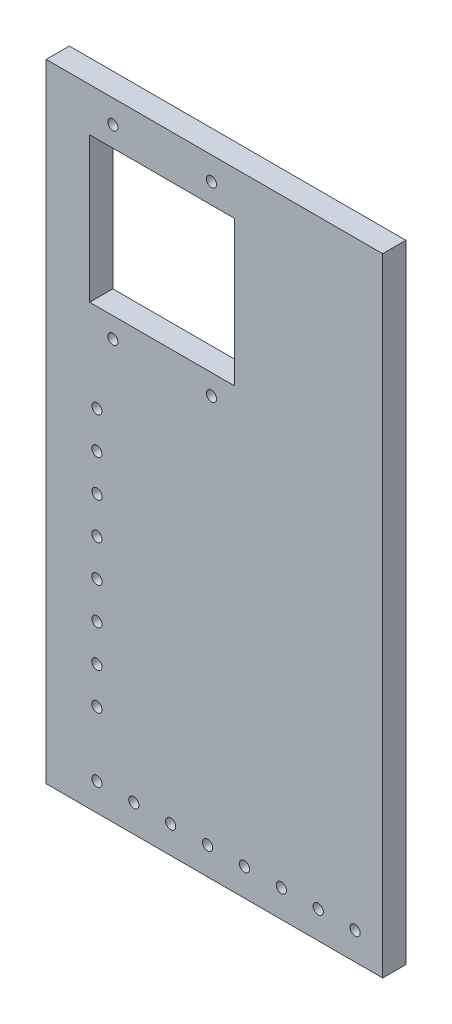
ISO-10303-21;
HEADER;
FILE_DESCRIPTION(('STEP AP214'),'2;1');
FILE_NAME('part.step','',(''),(''),'','','');
FILE_SCHEMA(('AUTOMOTIVE_DESIGN { 1 0 10303 214 1 1 1 1 }'));
ENDSEC;
DATA;
#1=APPLICATION_CONTEXT('core data for automotive mechanical design processes');
#2=APPLICATION_PROTOCOL_DEFINITION('international standard','automotive_design',2000,#1);
#3=PRODUCT_CONTEXT('',#1,'mechanical');
#4=PRODUCT('Part','Part','',(#3));
#5=PRODUCT_RELATED_PRODUCT_CATEGORY('part','',(#4));
#6=PRODUCT_DEFINITION_FORMATION('','',#4);
#7=PRODUCT_DEFINITION_CONTEXT('part definition',#1,'design');
#8=PRODUCT_DEFINITION('design','',#6,#7);
#9=PRODUCT_DEFINITION_SHAPE('','',#8);
#10=(LENGTH_UNIT() NAMED_UNIT(*) SI_UNIT(.MILLI.,.METRE.));
#11=(NAMED_UNIT(*) PLANE_ANGLE_UNIT() SI_UNIT($,.RADIAN.));
#12=(NAMED_UNIT(*) SI_UNIT($,.STERADIAN.) SOLID_ANGLE_UNIT());
#13=UNCERTAINTY_MEASURE_WITH_UNIT(LENGTH_MEASURE(1.E-05),#10,'distance_accuracy_value','');
#14=(GEOMETRIC_REPRESENTATION_CONTEXT(3) GLOBAL_UNCERTAINTY_ASSIGNED_CONTEXT((#13)) GLOBAL_UNIT_ASSIGNED_CONTEXT((#10,
#11,#12)) REPRESENTATION_CONTEXT('',''));
#15=CARTESIAN_POINT('',(0.,0.,0.));
#16=DIRECTION('',(0.,0.,1.));
#17=DIRECTION('',(1.,0.,0.));
#18=AXIS2_PLACEMENT_3D('',#15,#16,#17);
#19=CARTESIAN_POINT('',(-22.5,-144.5,100.));
#20=DIRECTION('',(0.,0.,-1.));
#21=DIRECTION('',(-1.,0.,0.));
#22=AXIS2_PLACEMENT_3D('',#19,#20,#21);
#23=CYLINDRICAL_SURFACE('',#22,1.75);
#24=CARTESIAN_POINT('',(-22.5,-144.5,8.00000000000001));
#25=DIRECTION('',(0.,0.,1.));
#26=DIRECTION('',(1.,0.,0.));
#27=AXIS2_PLACEMENT_3D('',#24,#25,#26);
#28=CIRCLE('',#27,1.75);
#29=CARTESIAN_POINT('',(-20.75,-144.5,8.00000000000001));
#30=VERTEX_POINT('',#29);
#31=EDGE_CURVE('E48',#30,#30,#28,.T.);
#32=ORIENTED_EDGE('',*,*,#31,.T.);
#33=EDGE_LOOP('',(#32));
#34=FACE_BOUND('',#33,.T.);
#35=CARTESIAN_POINT('',(-22.5,-144.5,0.));
#36=DIRECTION('',(0.,0.,-1.));
#37=DIRECTION('',(-1.,0.,0.));
#38=AXIS2_PLACEMENT_3D('',#35,#36,#37);
#39=CIRCLE('',#38,1.75);
#40=CARTESIAN_POINT('',(-24.25,-144.5,0.));
#41=VERTEX_POINT('',#40);
#42=EDGE_CURVE('E11',#41,#41,#39,.T.);
#43=ORIENTED_EDGE('',*,*,#42,.T.);
#44=EDGE_LOOP('',(#43));
#45=FACE_BOUND('',#44,.T.);
#46=ADVANCED_FACE('F41',(#34,#45),#23,.F.);
#47=CARTESIAN_POINT('',(-22.5,-131.785714285714,100.));
#48=DIRECTION('',(0.,0.,-1.));
#49=DIRECTION('',(-1.,0.,0.));
#50=AXIS2_PLACEMENT_3D('',#47,#48,#49);
#51=CYLINDRICAL_SURFACE('',#50,1.75);
#52=CARTESIAN_POINT('',(-22.5,-131.785714285714,8.00000000000001));
#53=DIRECTION('',(0.,0.,1.));
#54=DIRECTION('',(1.,0.,0.));
#55=AXIS2_PLACEMENT_3D('',#52,#53,#54);
#56=CIRCLE('',#55,1.75);
#57=CARTESIAN_POINT('',(-20.75,-131.785714285714,8.00000000000001));
#58=VERTEX_POINT('',#57);
#59=EDGE_CURVE('E258',#58,#58,#56,.T.);
#60=ORIENTED_EDGE('',*,*,#59,.T.);
#61=EDGE_LOOP('',(#60));
#62=FACE_BOUND('',#61,.T.);
#63=CARTESIAN_POINT('',(-22.5,-131.785714285714,0.));
#64=DIRECTION('',(0.,0.,-1.));
#65=DIRECTION('',(-1.,0.,0.));
#66=AXIS2_PLACEMENT_3D('',#63,#64,#65);
#67=CIRCLE('',#66,1.75);
#68=CARTESIAN_POINT('',(-24.25,-131.785714285714,0.));
#69=VERTEX_POINT('',#68);
#70=EDGE_CURVE('E261',#69,#69,#67,.T.);
#71=ORIENTED_EDGE('',*,*,#70,.T.);
#72=EDGE_LOOP('',(#71));
#73=FACE_BOUND('',#72,.T.);
#74=ADVANCED_FACE('F287',(#62,#73),#51,.F.);
#75=CARTESIAN_POINT('',(-22.5,-119.071428571429,100.));
#76=DIRECTION('',(0.,0.,-1.));
#77=DIRECTION('',(-1.,0.,0.));
#78=AXIS2_PLACEMENT_3D('',#75,#76,#77);
#79=CYLINDRICAL_SURFACE('',#78,1.75);
#80=CARTESIAN_POINT('',(-22.5,-119.071428571429,8.00000000000001));
#81=DIRECTION('',(0.,0.,1.));
#82=DIRECTION('',(1.,0.,0.));
#83=AXIS2_PLACEMENT_3D('',#80,#81,#82);
#84=CIRCLE('',#83,1.75);
#85=CARTESIAN_POINT('',(-20.75,-119.071428571429,8.00000000000001));
#86=VERTEX_POINT('',#85);
#87=EDGE_CURVE('E252',#86,#86,#84,.T.);
#88=ORIENTED_EDGE('',*,*,#87,.T.);
#89=EDGE_LOOP('',(#88));
#90=FACE_BOUND('',#89,.T.);
#91=CARTESIAN_POINT('',(-22.5,-119.071428571429,0.));
#92=DIRECTION('',(0.,0.,-1.));
#93=DIRECTION('',(-1.,0.,0.));
#94=AXIS2_PLACEMENT_3D('',#91,#92,#93);
#95=CIRCLE('',#94,1.75);
#96=CARTESIAN_POINT('',(-24.25,-119.071428571429,0.));
#97=VERTEX_POINT('',#96);
#98=EDGE_CURVE('E255',#97,#97,#95,.T.);
#99=ORIENTED_EDGE('',*,*,#98,.T.);
#100=EDGE_LOOP('',(#99));
#101=FACE_BOUND('',#100,.T.);
#102=ADVANCED_FACE('F291',(#90,#101),#79,.F.);
#103=CARTESIAN_POINT('',(-22.5,-106.357142857143,100.));
#104=DIRECTION('',(0.,0.,-1.));
#105=DIRECTION('',(-1.,0.,0.));
#106=AXIS2_PLACEMENT_3D('',#103,#104,#105);
#107=CYLINDRICAL_SURFACE('',#106,1.75);
#108=CARTESIAN_POINT('',(-22.5,-106.357142857143,8.00000000000001));
#109=DIRECTION('',(0.,0.,1.));
#110=DIRECTION('',(1.,0.,0.));
#111=AXIS2_PLACEMENT_3D('',#108,#109,#110);
#112=CIRCLE('',#111,1.75);
#113=CARTESIAN_POINT('',(-20.75,-106.357142857143,8.00000000000001));
#114=VERTEX_POINT('',#113);
#115=EDGE_CURVE('E246',#114,#114,#112,.T.);
#116=ORIENTED_EDGE('',*,*,#115,.T.);
#117=EDGE_LOOP('',(#116));
#118=FACE_BOUND('',#117,.T.);
#119=CARTESIAN_POINT('',(-22.5,-106.357142857143,0.));
#120=DIRECTION('',(0.,0.,-1.));
#121=DIRECTION('',(-1.,0.,0.));
#122=AXIS2_PLACEMENT_3D('',#119,#120,#121);
#123=CIRCLE('',#122,1.75);
#124=CARTESIAN_POINT('',(-24.25,-106.357142857143,0.));
#125=VERTEX_POINT('',#124);
#126=EDGE_CURVE('E249',#125,#125,#123,.T.);
#127=ORIENTED_EDGE('',*,*,#126,.T.);
#128=EDGE_LOOP('',(#127));
#129=FACE_BOUND('',#128,.T.);
#130=ADVANCED_FACE('F296',(#118,#129),#107,.F.);
#131=CARTESIAN_POINT('',(-22.5,-93.6428571428572,100.));
#132=DIRECTION('',(0.,0.,-1.));
#133=DIRECTION('',(-1.,0.,0.));
#134=AXIS2_PLACEMENT_3D('',#131,#132,#133);
#135=CYLINDRICAL_SURFACE('',#134,1.75);
#136=CARTESIAN_POINT('',(-22.5,-93.6428571428572,8.00000000000001));
#137=DIRECTION('',(0.,0.,1.));
#138=DIRECTION('',(1.,0.,0.));
#139=AXIS2_PLACEMENT_3D('',#136,#137,#138);
#140=CIRCLE('',#139,1.75);
#141=CARTESIAN_POINT('',(-20.75,-93.6428571428572,8.00000000000001));
#142=VERTEX_POINT('',#141);
#143=EDGE_CURVE('E240',#142,#142,#140,.T.);
#144=ORIENTED_EDGE('',*,*,#143,.T.);
#145=EDGE_LOOP('',(#144));
#146=FACE_BOUND('',#145,.T.);
#147=CARTESIAN_POINT('',(-22.5,-93.6428571428572,0.));
#148=DIRECTION('',(0.,0.,-1.));
#149=DIRECTION('',(-1.,0.,0.));
#150=AXIS2_PLACEMENT_3D('',#147,#148,#149);
#151=CIRCLE('',#150,1.75);
#152=CARTESIAN_POINT('',(-24.25,-93.6428571428572,0.));
#153=VERTEX_POINT('',#152);
#154=EDGE_CURVE('E243',#153,#153,#151,.T.);
#155=ORIENTED_EDGE('',*,*,#154,.T.);
#156=EDGE_LOOP('',(#155));
#157=FACE_BOUND('',#156,.T.);
#158=ADVANCED_FACE('F303',(#146,#157),#135,.F.);
#159=CARTESIAN_POINT('',(-22.5,-80.9285714285715,100.));
#160=DIRECTION('',(0.,0.,-1.));
#161=DIRECTION('',(-1.,0.,0.));
#162=AXIS2_PLACEMENT_3D('',#159,#160,#161);
#163=CYLINDRICAL_SURFACE('',#162,1.75);
#164=CARTESIAN_POINT('',(-22.5,-80.9285714285715,8.00000000000001));
#165=DIRECTION('',(0.,0.,1.));
#166=DIRECTION('',(1.,0.,0.));
#167=AXIS2_PLACEMENT_3D('',#164,#165,#166);
#168=CIRCLE('',#167,1.75);
#169=CARTESIAN_POINT('',(-20.75,-80.9285714285715,8.00000000000001));
#170=VERTEX_POINT('',#169);
#171=EDGE_CURVE('E234',#170,#170,#168,.T.);
#172=ORIENTED_EDGE('',*,*,#171,.T.);
#173=EDGE_LOOP('',(#172));
#174=FACE_BOUND('',#173,.T.);
#175=CARTESIAN_POINT('',(-22.5,-80.9285714285715,0.));
#176=DIRECTION('',(0.,0.,-1.));
#177=DIRECTION('',(-1.,0.,0.));
#178=AXIS2_PLACEMENT_3D('',#175,#176,#177);
#179=CIRCLE('',#178,1.75);
#180=CARTESIAN_POINT('',(-24.25,-80.9285714285715,0.));
#181=VERTEX_POINT('',#180);
#182=EDGE_CURVE('E237',#181,#181,#179,.T.);
#183=ORIENTED_EDGE('',*,*,#182,.T.);
#184=EDGE_LOOP('',(#183));
#185=FACE_BOUND('',#184,.T.);
#186=ADVANCED_FACE('F307',(#174,#185),#163,.F.);
#187=CARTESIAN_POINT('',(-22.5,-166.73,100.));
#188=DIRECTION('',(0.,0.,-1.));
#189=DIRECTION('',(-1.,0.,0.));
#190=AXIS2_PLACEMENT_3D('',#187,#188,#189);
#191=CYLINDRICAL_SURFACE('',#190,1.75);
#192=CARTESIAN_POINT('',(-22.5,-166.73,8.00000000000001));
#193=DIRECTION('',(0.,0.,1.));
#194=DIRECTION('',(1.,0.,0.));
#195=AXIS2_PLACEMENT_3D('',#192,#193,#194);
#196=CIRCLE('',#195,1.75);
#197=CARTESIAN_POINT('',(-20.75,-166.73,8.00000000000001));
#198=VERTEX_POINT('',#197);
#199=EDGE_CURVE('E228',#198,#198,#196,.T.);
#200=ORIENTED_EDGE('',*,*,#199,.T.);
#201=EDGE_LOOP('',(#200));
#202=FACE_BOUND('',#201,.T.);
#203=CARTESIAN_POINT('',(-22.5,-166.73,0.));
#204=DIRECTION('',(0.,0.,-1.));
#205=DIRECTION('',(-1.,0.,0.));
#206=AXIS2_PLACEMENT_3D('',#203,#204,#205);
#207=CIRCLE('',#206,1.75);
#208=CARTESIAN_POINT('',(-24.25,-166.73,0.));
#209=VERTEX_POINT('',#208);
#210=EDGE_CURVE('E231',#209,#209,#207,.T.);
#211=ORIENTED_EDGE('',*,*,#210,.T.);
#212=EDGE_LOOP('',(#211));
#213=FACE_BOUND('',#212,.T.);
#214=ADVANCED_FACE('F311',(#202,#213),#191,.F.);
#215=CARTESIAN_POINT('',(-9.78571428571427,-166.73,100.));
#216=DIRECTION('',(0.,0.,-1.));
#217=DIRECTION('',(-1.,0.,0.));
#218=AXIS2_PLACEMENT_3D('',#215,#216,#217);
#219=CYLINDRICAL_SURFACE('',#218,1.75);
#220=CARTESIAN_POINT('',(-9.78571428571427,-166.73,8.00000000000001));
#221=DIRECTION('',(0.,0.,1.));
#222=DIRECTION('',(1.,0.,0.));
#223=AXIS2_PLACEMENT_3D('',#220,#221,#222);
#224=CIRCLE('',#223,1.75);
#225=CARTESIAN_POINT('',(-8.03571428571427,-166.73,8.00000000000001));
#226=VERTEX_POINT('',#225);
#227=EDGE_CURVE('E222',#226,#226,#224,.T.);
#228=ORIENTED_EDGE('',*,*,#227,.T.);
#229=EDGE_LOOP('',(#228));
#230=FACE_BOUND('',#229,.T.);
#231=CARTESIAN_POINT('',(-9.78571428571427,-166.73,0.));
#232=DIRECTION('',(0.,0.,-1.));
#233=DIRECTION('',(-1.,0.,0.));
#234=AXIS2_PLACEMENT_3D('',#231,#232,#233);
#235=CIRCLE('',#234,1.75);
#236=CARTESIAN_POINT('',(-11.5357142857143,-166.73,0.));
#237=VERTEX_POINT('',#236);
#238=EDGE_CURVE('E225',#237,#237,#235,.T.);
#239=ORIENTED_EDGE('',*,*,#238,.T.);
#240=EDGE_LOOP('',(#239));
#241=FACE_BOUND('',#240,.T.);
#242=ADVANCED_FACE('F315',(#230,#241),#219,.F.);
#243=CARTESIAN_POINT('',(2.92857142857145,-166.73,100.));
#244=DIRECTION('',(0.,0.,-1.));
#245=DIRECTION('',(-1.,0.,0.));
#246=AXIS2_PLACEMENT_3D('',#243,#244,#245);
#247=CYLINDRICAL_SURFACE('',#246,1.75);
#248=CARTESIAN_POINT('',(2.92857142857145,-166.73,8.00000000000001));
#249=DIRECTION('',(0.,0.,1.));
#250=DIRECTION('',(1.,0.,0.));
#251=AXIS2_PLACEMENT_3D('',#248,#249,#250);
#252=CIRCLE('',#251,1.75);
#253=CARTESIAN_POINT('',(4.67857142857144,-166.73,8.00000000000001));
#254=VERTEX_POINT('',#253);
#255=EDGE_CURVE('E216',#254,#254,#252,.T.);
#256=ORIENTED_EDGE('',*,*,#255,.T.);
#257=EDGE_LOOP('',(#256));
#258=FACE_BOUND('',#257,.T.);
#259=CARTESIAN_POINT('',(2.92857142857145,-166.73,0.));
#260=DIRECTION('',(0.,0.,-1.));
#261=DIRECTION('',(-1.,0.,0.));
#262=AXIS2_PLACEMENT_3D('',#259,#260,#261);
#263=CIRCLE('',#262,1.75);
#264=CARTESIAN_POINT('',(1.17857142857145,-166.73,0.));
#265=VERTEX_POINT('',#264);
#266=EDGE_CURVE('E219',#265,#265,#263,.T.);
#267=ORIENTED_EDGE('',*,*,#266,.T.);
#268=EDGE_LOOP('',(#267));
#269=FACE_BOUND('',#268,.T.);
#270=ADVANCED_FACE('F319',(#258,#269),#247,.F.);
#271=CARTESIAN_POINT('',(15.6428571428572,-166.73,100.));
#272=DIRECTION('',(0.,0.,-1.));
#273=DIRECTION('',(-1.,0.,0.));
#274=AXIS2_PLACEMENT_3D('',#271,#272,#273);
#275=CYLINDRICAL_SURFACE('',#274,1.75);
#276=CARTESIAN_POINT('',(15.6428571428572,-166.73,8.00000000000001));
#277=DIRECTION('',(0.,0.,1.));
#278=DIRECTION('',(1.,0.,0.));
#279=AXIS2_PLACEMENT_3D('',#276,#277,#278);
#280=CIRCLE('',#279,1.75);
#281=CARTESIAN_POINT('',(17.3928571428572,-166.73,8.00000000000001));
#282=VERTEX_POINT('',#281);
#283=EDGE_CURVE('E210',#282,#282,#280,.T.);
#284=ORIENTED_EDGE('',*,*,#283,.T.);
#285=EDGE_LOOP('',(#284));
#286=FACE_BOUND('',#285,.T.);
#287=CARTESIAN_POINT('',(15.6428571428572,-166.73,0.));
#288=DIRECTION('',(0.,0.,-1.));
#289=DIRECTION('',(-1.,0.,0.));
#290=AXIS2_PLACEMENT_3D('',#287,#288,#289);
#291=CIRCLE('',#290,1.75);
#292=CARTESIAN_POINT('',(13.8928571428572,-166.73,0.));
#293=VERTEX_POINT('',#292);
#294=EDGE_CURVE('E213',#293,#293,#291,.T.);
#295=ORIENTED_EDGE('',*,*,#294,.T.);
#296=EDGE_LOOP('',(#295));
#297=FACE_BOUND('',#296,.T.);
#298=ADVANCED_FACE('F323',(#286,#297),#275,.F.);
#299=CARTESIAN_POINT('',(28.3571428571429,-166.73,100.));
#300=DIRECTION('',(0.,0.,-1.));
#301=DIRECTION('',(-1.,0.,0.));
#302=AXIS2_PLACEMENT_3D('',#299,#300,#301);
#303=CYLINDRICAL_SURFACE('',#302,1.75);
#304=CARTESIAN_POINT('',(28.3571428571429,-166.73,8.00000000000001));
#305=DIRECTION('',(0.,0.,1.));
#306=DIRECTION('',(1.,0.,0.));
#307=AXIS2_PLACEMENT_3D('',#304,#305,#306);
#308=CIRCLE('',#307,1.75);
#309=CARTESIAN_POINT('',(30.1071428571429,-166.73,8.00000000000001));
#310=VERTEX_POINT('',#309);
#311=EDGE_CURVE('E204',#310,#310,#308,.T.);
#312=ORIENTED_EDGE('',*,*,#311,.T.);
#313=EDGE_LOOP('',(#312));
#314=FACE_BOUND('',#313,.T.);
#315=CARTESIAN_POINT('',(28.3571428571429,-166.73,0.));
#316=DIRECTION('',(0.,0.,-1.));
#317=DIRECTION('',(-1.,0.,0.));
#318=AXIS2_PLACEMENT_3D('',#315,#316,#317);
#319=CIRCLE('',#318,1.75);
#320=CARTESIAN_POINT('',(26.6071428571429,-166.73,0.));
#321=VERTEX_POINT('',#320);
#322=EDGE_CURVE('E207',#321,#321,#319,.T.);
#323=ORIENTED_EDGE('',*,*,#322,.T.);
#324=EDGE_LOOP('',(#323));
#325=FACE_BOUND('',#324,.T.);
#326=ADVANCED_FACE('F280',(#314,#325),#303,.F.);
#327=CARTESIAN_POINT('',(41.0714285714286,-166.73,100.));
#328=DIRECTION('',(0.,0.,-1.));
#329=DIRECTION('',(-1.,0.,0.));
#330=AXIS2_PLACEMENT_3D('',#327,#328,#329);
#331=CYLINDRICAL_SURFACE('',#330,1.75);
#332=CARTESIAN_POINT('',(41.0714285714286,-166.73,8.00000000000001));
#333=DIRECTION('',(0.,0.,1.));
#334=DIRECTION('',(1.,0.,0.));
#335=AXIS2_PLACEMENT_3D('',#332,#333,#334);
#336=CIRCLE('',#335,1.75);
#337=CARTESIAN_POINT('',(42.8214285714286,-166.73,8.00000000000001));
#338=VERTEX_POINT('',#337);
#339=EDGE_CURVE('E198',#338,#338,#336,.T.);
#340=ORIENTED_EDGE('',*,*,#339,.T.);
#341=EDGE_LOOP('',(#340));
#342=FACE_BOUND('',#341,.T.);
#343=CARTESIAN_POINT('',(41.0714285714286,-166.73,0.));
#344=DIRECTION('',(0.,0.,-1.));
#345=DIRECTION('',(-1.,0.,0.));
#346=AXIS2_PLACEMENT_3D('',#343,#344,#345);
#347=CIRCLE('',#346,1.75);
#348=CARTESIAN_POINT('',(39.3214285714286,-166.73,0.));
#349=VERTEX_POINT('',#348);
#350=EDGE_CURVE('E201',#349,#349,#347,.T.);
#351=ORIENTED_EDGE('',*,*,#350,.T.);
#352=EDGE_LOOP('',(#351));
#353=FACE_BOUND('',#352,.T.);
#354=ADVANCED_FACE('F270',(#342,#353),#331,.F.);
#355=CARTESIAN_POINT('',(0.,0.,8.));
#356=DIRECTION('',(0.,0.,1.));
#357=DIRECTION('',(1.,0.,0.));
#358=AXIS2_PLACEMENT_3D('',#355,#356,#357);
#359=PLANE('',#358);
#360=CARTESIAN_POINT('',(-22.5,-68.2142857142857,8.00000000000001));
#361=DIRECTION('',(0.,0.,1.));
#362=DIRECTION('',(1.,0.,0.));
#363=AXIS2_PLACEMENT_3D('',#360,#361,#362);
#364=CIRCLE('',#363,1.75);
#365=CARTESIAN_POINT('',(-20.75,-68.2142857142857,8.00000000000001));
#366=VERTEX_POINT('',#365);
#367=EDGE_CURVE('E423',#366,#366,#364,.T.);
#368=ORIENTED_EDGE('',*,*,#367,.F.);
#369=EDGE_LOOP('',(#368));
#370=FACE_BOUND('',#369,.T.);
#371=CARTESIAN_POINT('',(-22.5,-55.5,8.00000000000001));
#372=DIRECTION('',(0.,0.,1.));
#373=DIRECTION('',(1.,0.,0.));
#374=AXIS2_PLACEMENT_3D('',#371,#372,#373);
#375=CIRCLE('',#374,1.75);
#376=CARTESIAN_POINT('',(-20.75,-55.5,8.00000000000001));
#377=VERTEX_POINT('',#376);
#378=EDGE_CURVE('E430',#377,#377,#375,.T.);
#379=ORIENTED_EDGE('',*,*,#378,.F.);
#380=EDGE_LOOP('',(#379));
#381=FACE_BOUND('',#380,.T.);
#382=CARTESIAN_POINT('',(53.7857142857143,-166.73,8.00000000000001));
#383=DIRECTION('',(0.,0.,1.));
#384=DIRECTION('',(1.,0.,0.));
#385=AXIS2_PLACEMENT_3D('',#382,#383,#384);
#386=CIRCLE('',#385,1.75);
#387=CARTESIAN_POINT('',(55.5357142857143,-166.73,8.00000000000001));
#388=VERTEX_POINT('',#387);
#389=EDGE_CURVE('E436',#388,#388,#386,.T.);
#390=ORIENTED_EDGE('',*,*,#389,.F.);
#391=EDGE_LOOP('',(#390));
#392=FACE_BOUND('',#391,.T.);
#393=CARTESIAN_POINT('',(66.5,-166.73,8.00000000000001));
#394=DIRECTION('',(0.,0.,1.));
#395=DIRECTION('',(1.,0.,0.));
#396=AXIS2_PLACEMENT_3D('',#393,#394,#395);
#397=CIRCLE('',#396,1.75);
#398=CARTESIAN_POINT('',(68.25,-166.73,8.00000000000001));
#399=VERTEX_POINT('',#398);
#400=EDGE_CURVE('E135',#399,#399,#397,.T.);
#401=ORIENTED_EDGE('',*,*,#400,.F.);
#402=EDGE_LOOP('',(#401));
#403=FACE_BOUND('',#402,.T.);
#404=CARTESIAN_POINT('',(-17.,-32.,8.));
#405=DIRECTION('',(0.,0.,1.));
#406=DIRECTION('',(1.,0.,0.));
#407=AXIS2_PLACEMENT_3D('',#404,#405,#406);
#408=CIRCLE('',#407,1.75);
#409=CARTESIAN_POINT('',(-15.25,-32.,8.));
#410=VERTEX_POINT('',#409);
#411=EDGE_CURVE('E151',#410,#410,#408,.T.);
#412=ORIENTED_EDGE('',*,*,#411,.F.);
#413=EDGE_LOOP('',(#412));
#414=FACE_BOUND('',#413,.T.);
#415=CARTESIAN_POINT('',(-17.,32.,8.));
#416=DIRECTION('',(0.,0.,1.));
#417=DIRECTION('',(1.,0.,0.));
#418=AXIS2_PLACEMENT_3D('',#415,#416,#417);
#419=CIRCLE('',#418,1.75);
#420=CARTESIAN_POINT('',(-15.25,32.,8.));
#421=VERTEX_POINT('',#420);
#422=EDGE_CURVE('E163',#421,#421,#419,.T.);
#423=ORIENTED_EDGE('',*,*,#422,.F.);
#424=EDGE_LOOP('',(#423));
#425=FACE_BOUND('',#424,.T.);
#426=DIRECTION('',(0.,1.,0.));
#427=VECTOR('',#426,1.);
#428=CARTESIAN_POINT('',(76.,40.,8.));
#429=LINE('',#428,#427);
#430=CARTESIAN_POINT('',(76.,-176.23,8.));
#431=VERTEX_POINT('',#430);
#432=CARTESIAN_POINT('',(76.,40.,8.));
#433=VERTEX_POINT('',#432);
#434=EDGE_CURVE('E169',#431,#433,#429,.T.);
#435=ORIENTED_EDGE('',*,*,#434,.T.);
#436=DIRECTION('',(-1.,0.,0.));
#437=VECTOR('',#436,1.);
#438=CARTESIAN_POINT('',(-40.,40.,8.));
#439=LINE('',#438,#437);
#440=CARTESIAN_POINT('',(-40.,40.,8.));
#441=VERTEX_POINT('',#440);
#442=EDGE_CURVE('E172',#433,#441,#439,.T.);
#443=ORIENTED_EDGE('',*,*,#442,.T.);
#444=DIRECTION('',(0.,-1.,0.));
#445=VECTOR('',#444,1.);
#446=CARTESIAN_POINT('',(-40.,40.,8.));
#447=LINE('',#446,#445);
#448=CARTESIAN_POINT('',(-40.,-176.23,8.));
#449=VERTEX_POINT('',#448);
#450=EDGE_CURVE('E175',#441,#449,#447,.T.);
#451=ORIENTED_EDGE('',*,*,#450,.T.);
#452=DIRECTION('',(1.,0.,0.));
#453=VECTOR('',#452,1.);
#454=CARTESIAN_POINT('',(-40.,-176.23,8.));
#455=LINE('',#454,#453);
#456=EDGE_CURVE('E177',#449,#431,#455,.T.);
#457=ORIENTED_EDGE('',*,*,#456,.T.);
#458=EDGE_LOOP('',(#435,#443,#451,#457));
#459=FACE_BOUND('',#458,.T.);
#460=CARTESIAN_POINT('',(17.,32.,8.));
#461=DIRECTION('',(0.,0.,1.));
#462=DIRECTION('',(1.,0.,0.));
#463=AXIS2_PLACEMENT_3D('',#460,#461,#462);
#464=CIRCLE('',#463,1.75);
#465=CARTESIAN_POINT('',(18.75,32.,8.));
#466=VERTEX_POINT('',#465);
#467=EDGE_CURVE('E157',#466,#466,#464,.T.);
#468=ORIENTED_EDGE('',*,*,#467,.F.);
#469=EDGE_LOOP('',(#468));
#470=FACE_BOUND('',#469,.T.);
#471=CARTESIAN_POINT('',(17.,-32.,8.));
#472=DIRECTION('',(0.,0.,1.));
#473=DIRECTION('',(1.,0.,0.));
#474=AXIS2_PLACEMENT_3D('',#471,#472,#473);
#475=CIRCLE('',#474,1.75);
#476=CARTESIAN_POINT('',(18.75,-32.,8.));
#477=VERTEX_POINT('',#476);
#478=EDGE_CURVE('E145',#477,#477,#475,.T.);
#479=ORIENTED_EDGE('',*,*,#478,.F.);
#480=EDGE_LOOP('',(#479));
#481=FACE_BOUND('',#480,.T.);
#482=DIRECTION('',(-1.,0.,0.));
#483=VECTOR('',#482,1.);
#484=CARTESIAN_POINT('',(-25.,25.,8.));
#485=LINE('',#484,#483);
#486=CARTESIAN_POINT('',(25.,25.,8.));
#487=VERTEX_POINT('',#486);
#488=CARTESIAN_POINT('',(-25.,25.,8.));
#489=VERTEX_POINT('',#488);
#490=EDGE_CURVE('E113',#487,#489,#485,.T.);
#491=ORIENTED_EDGE('',*,*,#490,.F.);
#492=DIRECTION('',(0.,1.,0.));
#493=VECTOR('',#492,1.);
#494=CARTESIAN_POINT('',(25.,25.,8.));
#495=LINE('',#494,#493);
#496=CARTESIAN_POINT('',(25.,-25.,8.));
#497=VERTEX_POINT('',#496);
#498=EDGE_CURVE('E105',#497,#487,#495,.T.);
#499=ORIENTED_EDGE('',*,*,#498,.F.);
#500=DIRECTION('',(1.,0.,0.));
#501=VECTOR('',#500,1.);
#502=CARTESIAN_POINT('',(-25.,-25.,8.));
#503=LINE('',#502,#501);
#504=CARTESIAN_POINT('',(-25.,-25.,8.));
#505=VERTEX_POINT('',#504);
#506=EDGE_CURVE('E129',#505,#497,#503,.T.);
#507=ORIENTED_EDGE('',*,*,#506,.F.);
#508=DIRECTION('',(0.,-1.,0.));
#509=VECTOR('',#508,1.);
#510=CARTESIAN_POINT('',(-25.,25.,8.));
#511=LINE('',#510,#509);
#512=EDGE_CURVE('E127',#489,#505,#511,.T.);
#513=ORIENTED_EDGE('',*,*,#512,.F.);
#514=EDGE_LOOP('',(#491,#499,#507,#513));
#515=FACE_BOUND('',#514,.T.);
#516=ORIENTED_EDGE('',*,*,#339,.F.);
#517=EDGE_LOOP('',(#516));
#518=FACE_BOUND('',#517,.T.);
#519=ORIENTED_EDGE('',*,*,#311,.F.);
#520=EDGE_LOOP('',(#519));
#521=FACE_BOUND('',#520,.T.);
#522=ORIENTED_EDGE('',*,*,#283,.F.);
#523=EDGE_LOOP('',(#522));
#524=FACE_BOUND('',#523,.T.);
#525=ORIENTED_EDGE('',*,*,#255,.F.);
#526=EDGE_LOOP('',(#525));
#527=FACE_BOUND('',#526,.T.);
#528=ORIENTED_EDGE('',*,*,#227,.F.);
#529=EDGE_LOOP('',(#528));
#530=FACE_BOUND('',#529,.T.);
#531=ORIENTED_EDGE('',*,*,#199,.F.);
#532=EDGE_LOOP('',(#531));
#533=FACE_BOUND('',#532,.T.);
#534=ORIENTED_EDGE('',*,*,#171,.F.);
#535=EDGE_LOOP('',(#534));
#536=FACE_BOUND('',#535,.T.);
#537=ORIENTED_EDGE('',*,*,#143,.F.);
#538=EDGE_LOOP('',(#537));
#539=FACE_BOUND('',#538,.T.);
#540=ORIENTED_EDGE('',*,*,#115,.F.);
#541=EDGE_LOOP('',(#540));
#542=FACE_BOUND('',#541,.T.);
#543=ORIENTED_EDGE('',*,*,#87,.F.);
#544=EDGE_LOOP('',(#543));
#545=FACE_BOUND('',#544,.T.);
#546=ORIENTED_EDGE('',*,*,#59,.F.);
#547=EDGE_LOOP('',(#546));
#548=FACE_BOUND('',#547,.T.);
#549=ORIENTED_EDGE('',*,*,#31,.F.);
#550=EDGE_LOOP('',(#549));
#551=FACE_BOUND('',#550,.T.);
#552=ADVANCED_FACE('F125',(#370,#381,#392,#403,#414,#425,#459,#470,#481,#515,#518,#521,#524,
#527,#530,#533,#536,#539,#542,#545,#548,#551),#359,.T.);
#553=CARTESIAN_POINT('',(0.,0.,0.));
#554=DIRECTION('',(0.,0.,1.));
#555=DIRECTION('',(1.,0.,0.));
#556=AXIS2_PLACEMENT_3D('',#553,#554,#555);
#557=PLANE('',#556);
#558=CARTESIAN_POINT('',(-22.5,-68.2142857142857,0.));
#559=DIRECTION('',(0.,0.,-1.));
#560=DIRECTION('',(-1.,0.,0.));
#561=AXIS2_PLACEMENT_3D('',#558,#559,#560);
#562=CIRCLE('',#561,1.75);
#563=CARTESIAN_POINT('',(-24.25,-68.2142857142857,0.));
#564=VERTEX_POINT('',#563);
#565=EDGE_CURVE('E426',#564,#564,#562,.T.);
#566=ORIENTED_EDGE('',*,*,#565,.F.);
#567=EDGE_LOOP('',(#566));
#568=FACE_BOUND('',#567,.T.);
#569=CARTESIAN_POINT('',(-22.5,-55.5,0.));
#570=DIRECTION('',(0.,0.,-1.));
#571=DIRECTION('',(-1.,0.,0.));
#572=AXIS2_PLACEMENT_3D('',#569,#570,#571);
#573=CIRCLE('',#572,1.75);
#574=CARTESIAN_POINT('',(-24.25,-55.5,0.));
#575=VERTEX_POINT('',#574);
#576=EDGE_CURVE('E427',#575,#575,#573,.T.);
#577=ORIENTED_EDGE('',*,*,#576,.F.);
#578=EDGE_LOOP('',(#577));
#579=FACE_BOUND('',#578,.T.);
#580=CARTESIAN_POINT('',(53.7857142857143,-166.73,0.));
#581=DIRECTION('',(0.,0.,-1.));
#582=DIRECTION('',(-1.,0.,0.));
#583=AXIS2_PLACEMENT_3D('',#580,#581,#582);
#584=CIRCLE('',#583,1.75);
#585=CARTESIAN_POINT('',(52.0357142857143,-166.73,0.));
#586=VERTEX_POINT('',#585);
#587=EDGE_CURVE('E439',#586,#586,#584,.T.);
#588=ORIENTED_EDGE('',*,*,#587,.F.);
#589=EDGE_LOOP('',(#588));
#590=FACE_BOUND('',#589,.T.);
#591=CARTESIAN_POINT('',(66.5,-166.73,0.));
#592=DIRECTION('',(0.,0.,-1.));
#593=DIRECTION('',(-1.,0.,0.));
#594=AXIS2_PLACEMENT_3D('',#591,#592,#593);
#595=CIRCLE('',#594,1.75);
#596=CARTESIAN_POINT('',(64.75,-166.73,0.));
#597=VERTEX_POINT('',#596);
#598=EDGE_CURVE('E442',#597,#597,#595,.T.);
#599=ORIENTED_EDGE('',*,*,#598,.F.);
#600=EDGE_LOOP('',(#599));
#601=FACE_BOUND('',#600,.T.);
#602=CARTESIAN_POINT('',(17.,-32.,0.));
#603=DIRECTION('',(0.,0.,1.));
#604=DIRECTION('',(1.,0.,0.));
#605=AXIS2_PLACEMENT_3D('',#602,#603,#604);
#606=CIRCLE('',#605,1.75);
#607=CARTESIAN_POINT('',(18.75,-32.,0.));
#608=VERTEX_POINT('',#607);
#609=EDGE_CURVE('E121',#608,#608,#606,.T.);
#610=ORIENTED_EDGE('',*,*,#609,.T.);
#611=EDGE_LOOP('',(#610));
#612=FACE_BOUND('',#611,.T.);
#613=CARTESIAN_POINT('',(-17.,-32.,0.));
#614=DIRECTION('',(0.,0.,1.));
#615=DIRECTION('',(1.,0.,0.));
#616=AXIS2_PLACEMENT_3D('',#613,#614,#615);
#617=CIRCLE('',#616,1.75);
#618=CARTESIAN_POINT('',(-15.25,-32.,0.));
#619=VERTEX_POINT('',#618);
#620=EDGE_CURVE('E148',#619,#619,#617,.T.);
#621=ORIENTED_EDGE('',*,*,#620,.T.);
#622=EDGE_LOOP('',(#621));
#623=FACE_BOUND('',#622,.T.);
#624=CARTESIAN_POINT('',(17.,32.,0.));
#625=DIRECTION('',(0.,0.,1.));
#626=DIRECTION('',(1.,0.,0.));
#627=AXIS2_PLACEMENT_3D('',#624,#625,#626);
#628=CIRCLE('',#627,1.75);
#629=CARTESIAN_POINT('',(18.75,32.,0.));
#630=VERTEX_POINT('',#629);
#631=EDGE_CURVE('E154',#630,#630,#628,.T.);
#632=ORIENTED_EDGE('',*,*,#631,.T.);
#633=EDGE_LOOP('',(#632));
#634=FACE_BOUND('',#633,.T.);
#635=CARTESIAN_POINT('',(-17.,32.,0.));
#636=DIRECTION('',(0.,0.,1.));
#637=DIRECTION('',(1.,0.,0.));
#638=AXIS2_PLACEMENT_3D('',#635,#636,#637);
#639=CIRCLE('',#638,1.75);
#640=CARTESIAN_POINT('',(-15.25,32.,0.));
#641=VERTEX_POINT('',#640);
#642=EDGE_CURVE('E160',#641,#641,#639,.T.);
#643=ORIENTED_EDGE('',*,*,#642,.T.);
#644=EDGE_LOOP('',(#643));
#645=FACE_BOUND('',#644,.T.);
#646=DIRECTION('',(0.,1.,0.));
#647=VECTOR('',#646,1.);
#648=CARTESIAN_POINT('',(76.,40.,0.));
#649=LINE('',#648,#647);
#650=CARTESIAN_POINT('',(76.,-176.23,0.));
#651=VERTEX_POINT('',#650);
#652=CARTESIAN_POINT('',(76.,40.,0.));
#653=VERTEX_POINT('',#652);
#654=EDGE_CURVE('E166',#651,#653,#649,.T.);
#655=ORIENTED_EDGE('',*,*,#654,.F.);
#656=DIRECTION('',(1.,0.,0.));
#657=VECTOR('',#656,1.);
#658=CARTESIAN_POINT('',(-40.,-176.23,0.));
#659=LINE('',#658,#657);
#660=CARTESIAN_POINT('',(-40.,-176.23,0.));
#661=VERTEX_POINT('',#660);
#662=EDGE_CURVE('E173',#661,#651,#659,.T.);
#663=ORIENTED_EDGE('',*,*,#662,.F.);
#664=DIRECTION('',(0.,-1.,0.));
#665=VECTOR('',#664,1.);
#666=CARTESIAN_POINT('',(-40.,40.,0.));
#667=LINE('',#666,#665);
#668=CARTESIAN_POINT('',(-40.,40.,0.));
#669=VERTEX_POINT('',#668);
#670=EDGE_CURVE('E184',#669,#661,#667,.T.);
#671=ORIENTED_EDGE('',*,*,#670,.F.);
#672=DIRECTION('',(-1.,0.,0.));
#673=VECTOR('',#672,1.);
#674=CARTESIAN_POINT('',(-40.,40.,0.));
#675=LINE('',#674,#673);
#676=EDGE_CURVE('E182',#653,#669,#675,.T.);
#677=ORIENTED_EDGE('',*,*,#676,.F.);
#678=EDGE_LOOP('',(#655,#663,#671,#677));
#679=FACE_BOUND('',#678,.T.);
#680=DIRECTION('',(0.,1.,0.));
#681=VECTOR('',#680,1.);
#682=CARTESIAN_POINT('',(25.,25.,0.));
#683=LINE('',#682,#681);
#684=CARTESIAN_POINT('',(25.,-25.,0.));
#685=VERTEX_POINT('',#684);
#686=CARTESIAN_POINT('',(25.,25.,0.));
#687=VERTEX_POINT('',#686);
#688=EDGE_CURVE('E63',#685,#687,#683,.T.);
#689=ORIENTED_EDGE('',*,*,#688,.T.);
#690=DIRECTION('',(-1.,0.,0.));
#691=VECTOR('',#690,1.);
#692=CARTESIAN_POINT('',(-25.,25.,0.));
#693=LINE('',#692,#691);
#694=CARTESIAN_POINT('',(-25.,25.,0.));
#695=VERTEX_POINT('',#694);
#696=EDGE_CURVE('E120',#687,#695,#693,.T.);
#697=ORIENTED_EDGE('',*,*,#696,.T.);
#698=DIRECTION('',(0.,-1.,0.));
#699=VECTOR('',#698,1.);
#700=CARTESIAN_POINT('',(-25.,25.,0.));
#701=LINE('',#700,#699);
#702=CARTESIAN_POINT('',(-25.,-25.,0.));
#703=VERTEX_POINT('',#702);
#704=EDGE_CURVE('E137',#695,#703,#701,.T.);
#705=ORIENTED_EDGE('',*,*,#704,.T.);
#706=DIRECTION('',(1.,0.,0.));
#707=VECTOR('',#706,1.);
#708=CARTESIAN_POINT('',(-25.,-25.,0.));
#709=LINE('',#708,#707);
#710=EDGE_CURVE('E114',#703,#685,#709,.T.);
#711=ORIENTED_EDGE('',*,*,#710,.T.);
#712=EDGE_LOOP('',(#689,#697,#705,#711));
#713=FACE_BOUND('',#712,.T.);
#714=ORIENTED_EDGE('',*,*,#350,.F.);
#715=EDGE_LOOP('',(#714));
#716=FACE_BOUND('',#715,.T.);
#717=ORIENTED_EDGE('',*,*,#322,.F.);
#718=EDGE_LOOP('',(#717));
#719=FACE_BOUND('',#718,.T.);
#720=ORIENTED_EDGE('',*,*,#294,.F.);
#721=EDGE_LOOP('',(#720));
#722=FACE_BOUND('',#721,.T.);
#723=ORIENTED_EDGE('',*,*,#266,.F.);
#724=EDGE_LOOP('',(#723));
#725=FACE_BOUND('',#724,.T.);
#726=ORIENTED_EDGE('',*,*,#238,.F.);
#727=EDGE_LOOP('',(#726));
#728=FACE_BOUND('',#727,.T.);
#729=ORIENTED_EDGE('',*,*,#210,.F.);
#730=EDGE_LOOP('',(#729));
#731=FACE_BOUND('',#730,.T.);
#732=ORIENTED_EDGE('',*,*,#182,.F.);
#733=EDGE_LOOP('',(#732));
#734=FACE_BOUND('',#733,.T.);
#735=ORIENTED_EDGE('',*,*,#154,.F.);
#736=EDGE_LOOP('',(#735));
#737=FACE_BOUND('',#736,.T.);
#738=ORIENTED_EDGE('',*,*,#126,.F.);
#739=EDGE_LOOP('',(#738));
#740=FACE_BOUND('',#739,.T.);
#741=ORIENTED_EDGE('',*,*,#98,.F.);
#742=EDGE_LOOP('',(#741));
#743=FACE_BOUND('',#742,.T.);
#744=ORIENTED_EDGE('',*,*,#70,.F.);
#745=EDGE_LOOP('',(#744));
#746=FACE_BOUND('',#745,.T.);
#747=ORIENTED_EDGE('',*,*,#42,.F.);
#748=EDGE_LOOP('',(#747));
#749=FACE_BOUND('',#748,.T.);
#750=ADVANCED_FACE('F269',(#568,#579,#590,#601,#612,#623,#634,#645,#679,#713,#716,#719,#722,
#725,#728,#731,#734,#737,#740,#743,#746,#749),#557,.F.);
#751=CARTESIAN_POINT('',(76.,40.,8.));
#752=DIRECTION('',(-1.,0.,0.));
#753=DIRECTION('',(0.,-1.,0.));
#754=AXIS2_PLACEMENT_3D('',#751,#752,#753);
#755=PLANE('',#754);
#756=ORIENTED_EDGE('',*,*,#654,.T.);
#757=DIRECTION('',(0.,0.,-1.));
#758=VECTOR('',#757,1.);
#759=CARTESIAN_POINT('',(76.,40.,8.));
#760=LINE('',#759,#758);
#761=EDGE_CURVE('E195',#433,#653,#760,.T.);
#762=ORIENTED_EDGE('',*,*,#761,.F.);
#763=ORIENTED_EDGE('',*,*,#434,.F.);
#764=DIRECTION('',(0.,0.,-1.));
#765=VECTOR('',#764,1.);
#766=CARTESIAN_POINT('',(76.,-176.23,8.));
#767=LINE('',#766,#765);
#768=EDGE_CURVE('E179',#431,#651,#767,.T.);
#769=ORIENTED_EDGE('',*,*,#768,.T.);
#770=EDGE_LOOP('',(#756,#762,#763,#769));
#771=FACE_BOUND('',#770,.T.);
#772=ADVANCED_FACE('F277',(#771),#755,.F.);
#773=CARTESIAN_POINT('',(-40.,40.,8.));
#774=DIRECTION('',(0.,-1.,0.));
#775=DIRECTION('',(1.,0.,0.));
#776=AXIS2_PLACEMENT_3D('',#773,#774,#775);
#777=PLANE('',#776);
#778=ORIENTED_EDGE('',*,*,#676,.T.);
#779=DIRECTION('',(0.,0.,-1.));
#780=VECTOR('',#779,1.);
#781=CARTESIAN_POINT('',(-40.,40.,8.));
#782=LINE('',#781,#780);
#783=EDGE_CURVE('E192',#441,#669,#782,.T.);
#784=ORIENTED_EDGE('',*,*,#783,.F.);
#785=ORIENTED_EDGE('',*,*,#442,.F.);
#786=ORIENTED_EDGE('',*,*,#761,.T.);
#787=EDGE_LOOP('',(#778,#784,#785,#786));
#788=FACE_BOUND('',#787,.T.);
#789=ADVANCED_FACE('F333',(#788),#777,.F.);
#790=CARTESIAN_POINT('',(-40.,40.,8.));
#791=DIRECTION('',(1.,0.,0.));
#792=DIRECTION('',(0.,1.,0.));
#793=AXIS2_PLACEMENT_3D('',#790,#791,#792);
#794=PLANE('',#793);
#795=ORIENTED_EDGE('',*,*,#670,.T.);
#796=DIRECTION('',(0.,0.,-1.));
#797=VECTOR('',#796,1.);
#798=CARTESIAN_POINT('',(-40.,-176.23,8.));
#799=LINE('',#798,#797);
#800=EDGE_CURVE('E189',#449,#661,#799,.T.);
#801=ORIENTED_EDGE('',*,*,#800,.F.);
#802=ORIENTED_EDGE('',*,*,#450,.F.);
#803=ORIENTED_EDGE('',*,*,#783,.T.);
#804=EDGE_LOOP('',(#795,#801,#802,#803));
#805=FACE_BOUND('',#804,.T.);
#806=ADVANCED_FACE('F337',(#805),#794,.F.);
#807=CARTESIAN_POINT('',(-40.,-176.23,8.));
#808=DIRECTION('',(0.,1.,0.));
#809=DIRECTION('',(-1.,0.,0.));
#810=AXIS2_PLACEMENT_3D('',#807,#808,#809);
#811=PLANE('',#810);
#812=ORIENTED_EDGE('',*,*,#662,.T.);
#813=ORIENTED_EDGE('',*,*,#768,.F.);
#814=ORIENTED_EDGE('',*,*,#456,.F.);
#815=ORIENTED_EDGE('',*,*,#800,.T.);
#816=EDGE_LOOP('',(#812,#813,#814,#815));
#817=FACE_BOUND('',#816,.T.);
#818=ADVANCED_FACE('F341',(#817),#811,.F.);
#819=CARTESIAN_POINT('',(-17.,32.,8.));
#820=DIRECTION('',(0.,0.,-1.));
#821=DIRECTION('',(-1.,0.,0.));
#822=AXIS2_PLACEMENT_3D('',#819,#820,#821);
#823=CYLINDRICAL_SURFACE('',#822,1.75);
#824=ORIENTED_EDGE('',*,*,#422,.T.);
#825=EDGE_LOOP('',(#824));
#826=FACE_BOUND('',#825,.T.);
#827=ORIENTED_EDGE('',*,*,#642,.F.);
#828=EDGE_LOOP('',(#827));
#829=FACE_BOUND('',#828,.T.);
#830=ADVANCED_FACE('F344',(#826,#829),#823,.F.);
#831=CARTESIAN_POINT('',(17.,32.,8.));
#832=DIRECTION('',(0.,0.,-1.));
#833=DIRECTION('',(-1.,0.,0.));
#834=AXIS2_PLACEMENT_3D('',#831,#832,#833);
#835=CYLINDRICAL_SURFACE('',#834,1.75);
#836=ORIENTED_EDGE('',*,*,#467,.T.);
#837=EDGE_LOOP('',(#836));
#838=FACE_BOUND('',#837,.T.);
#839=ORIENTED_EDGE('',*,*,#631,.F.);
#840=EDGE_LOOP('',(#839));
#841=FACE_BOUND('',#840,.T.);
#842=ADVANCED_FACE('F349',(#838,#841),#835,.F.);
#843=CARTESIAN_POINT('',(-17.,-32.,8.));
#844=DIRECTION('',(0.,0.,-1.));
#845=DIRECTION('',(-1.,0.,0.));
#846=AXIS2_PLACEMENT_3D('',#843,#844,#845);
#847=CYLINDRICAL_SURFACE('',#846,1.75);
#848=ORIENTED_EDGE('',*,*,#411,.T.);
#849=EDGE_LOOP('',(#848));
#850=FACE_BOUND('',#849,.T.);
#851=ORIENTED_EDGE('',*,*,#620,.F.);
#852=EDGE_LOOP('',(#851));
#853=FACE_BOUND('',#852,.T.);
#854=ADVANCED_FACE('F372',(#850,#853),#847,.F.);
#855=CARTESIAN_POINT('',(17.,-32.,8.));
#856=DIRECTION('',(0.,0.,-1.));
#857=DIRECTION('',(-1.,0.,0.));
#858=AXIS2_PLACEMENT_3D('',#855,#856,#857);
#859=CYLINDRICAL_SURFACE('',#858,1.75);
#860=ORIENTED_EDGE('',*,*,#478,.T.);
#861=EDGE_LOOP('',(#860));
#862=FACE_BOUND('',#861,.T.);
#863=ORIENTED_EDGE('',*,*,#609,.F.);
#864=EDGE_LOOP('',(#863));
#865=FACE_BOUND('',#864,.T.);
#866=ADVANCED_FACE('F369',(#862,#865),#859,.F.);
#867=CARTESIAN_POINT('',(25.,25.,8.));
#868=DIRECTION('',(-1.,0.,0.));
#869=DIRECTION('',(0.,0.,1.));
#870=AXIS2_PLACEMENT_3D('',#867,#868,#869);
#871=PLANE('',#870);
#872=ORIENTED_EDGE('',*,*,#688,.F.);
#873=DIRECTION('',(0.,0.,-1.));
#874=VECTOR('',#873,1.);
#875=CARTESIAN_POINT('',(25.,-25.,8.));
#876=LINE('',#875,#874);
#877=EDGE_CURVE('E109',#497,#685,#876,.T.);
#878=ORIENTED_EDGE('',*,*,#877,.F.);
#879=ORIENTED_EDGE('',*,*,#498,.T.);
#880=DIRECTION('',(0.,0.,-1.));
#881=VECTOR('',#880,1.);
#882=CARTESIAN_POINT('',(25.,25.,8.));
#883=LINE('',#882,#881);
#884=EDGE_CURVE('E108',#487,#687,#883,.T.);
#885=ORIENTED_EDGE('',*,*,#884,.T.);
#886=EDGE_LOOP('',(#872,#878,#879,#885));
#887=FACE_BOUND('',#886,.T.);
#888=ADVANCED_FACE('F107',(#887),#871,.T.);
#889=CARTESIAN_POINT('',(-25.,25.,8.));
#890=DIRECTION('',(0.,-1.,0.));
#891=DIRECTION('',(0.,0.,-1.));
#892=AXIS2_PLACEMENT_3D('',#889,#890,#891);
#893=PLANE('',#892);
#894=ORIENTED_EDGE('',*,*,#696,.F.);
#895=ORIENTED_EDGE('',*,*,#884,.F.);
#896=ORIENTED_EDGE('',*,*,#490,.T.);
#897=DIRECTION('',(0.,0.,-1.));
#898=VECTOR('',#897,1.);
#899=CARTESIAN_POINT('',(-25.,25.,8.));
#900=LINE('',#899,#898);
#901=EDGE_CURVE('E122',#489,#695,#900,.T.);
#902=ORIENTED_EDGE('',*,*,#901,.T.);
#903=EDGE_LOOP('',(#894,#895,#896,#902));
#904=FACE_BOUND('',#903,.T.);
#905=ADVANCED_FACE('F117',(#904),#893,.T.);
#906=CARTESIAN_POINT('',(-25.,25.,8.));
#907=DIRECTION('',(1.,0.,0.));
#908=DIRECTION('',(0.,0.,-1.));
#909=AXIS2_PLACEMENT_3D('',#906,#907,#908);
#910=PLANE('',#909);
#911=ORIENTED_EDGE('',*,*,#704,.F.);
#912=ORIENTED_EDGE('',*,*,#901,.F.);
#913=ORIENTED_EDGE('',*,*,#512,.T.);
#914=DIRECTION('',(0.,0.,-1.));
#915=VECTOR('',#914,1.);
#916=CARTESIAN_POINT('',(-25.,-25.,8.));
#917=LINE('',#916,#915);
#918=EDGE_CURVE('E55',#505,#703,#917,.T.);
#919=ORIENTED_EDGE('',*,*,#918,.T.);
#920=EDGE_LOOP('',(#911,#912,#913,#919));
#921=FACE_BOUND('',#920,.T.);
#922=ADVANCED_FACE('F397',(#921),#910,.T.);
#923=CARTESIAN_POINT('',(-25.,-25.,8.));
#924=DIRECTION('',(0.,1.,0.));
#925=DIRECTION('',(0.,0.,1.));
#926=AXIS2_PLACEMENT_3D('',#923,#924,#925);
#927=PLANE('',#926);
#928=ORIENTED_EDGE('',*,*,#710,.F.);
#929=ORIENTED_EDGE('',*,*,#918,.F.);
#930=ORIENTED_EDGE('',*,*,#506,.T.);
#931=ORIENTED_EDGE('',*,*,#877,.T.);
#932=EDGE_LOOP('',(#928,#929,#930,#931));
#933=FACE_BOUND('',#932,.T.);
#934=ADVANCED_FACE('F400',(#933),#927,.T.);
#935=CARTESIAN_POINT('',(66.5,-166.73,100.));
#936=DIRECTION('',(0.,0.,-1.));
#937=DIRECTION('',(-1.,0.,0.));
#938=AXIS2_PLACEMENT_3D('',#935,#936,#937);
#939=CYLINDRICAL_SURFACE('',#938,1.75);
#940=ORIENTED_EDGE('',*,*,#400,.T.);
#941=EDGE_LOOP('',(#940));
#942=FACE_BOUND('',#941,.T.);
#943=ORIENTED_EDGE('',*,*,#598,.T.);
#944=EDGE_LOOP('',(#943));
#945=FACE_BOUND('',#944,.T.);
#946=ADVANCED_FACE('F404',(#942,#945),#939,.F.);
#947=CARTESIAN_POINT('',(53.7857142857143,-166.73,100.));
#948=DIRECTION('',(0.,0.,-1.));
#949=DIRECTION('',(-1.,0.,0.));
#950=AXIS2_PLACEMENT_3D('',#947,#948,#949);
#951=CYLINDRICAL_SURFACE('',#950,1.75);
#952=ORIENTED_EDGE('',*,*,#389,.T.);
#953=EDGE_LOOP('',(#952));
#954=FACE_BOUND('',#953,.T.);
#955=ORIENTED_EDGE('',*,*,#587,.T.);
#956=EDGE_LOOP('',(#955));
#957=FACE_BOUND('',#956,.T.);
#958=ADVANCED_FACE('F407',(#954,#957),#951,.F.);
#959=CARTESIAN_POINT('',(-22.5,-55.5,100.));
#960=DIRECTION('',(0.,0.,-1.));
#961=DIRECTION('',(-1.,0.,0.));
#962=AXIS2_PLACEMENT_3D('',#959,#960,#961);
#963=CYLINDRICAL_SURFACE('',#962,1.75);
#964=ORIENTED_EDGE('',*,*,#378,.T.);
#965=EDGE_LOOP('',(#964));
#966=FACE_BOUND('',#965,.T.);
#967=ORIENTED_EDGE('',*,*,#576,.T.);
#968=EDGE_LOOP('',(#967));
#969=FACE_BOUND('',#968,.T.);
#970=ADVANCED_FACE('F411',(#966,#969),#963,.F.);
#971=CARTESIAN_POINT('',(-22.5,-68.2142857142857,100.));
#972=DIRECTION('',(0.,0.,-1.));
#973=DIRECTION('',(-1.,0.,0.));
#974=AXIS2_PLACEMENT_3D('',#971,#972,#973);
#975=CYLINDRICAL_SURFACE('',#974,1.75);
#976=ORIENTED_EDGE('',*,*,#367,.T.);
#977=EDGE_LOOP('',(#976));
#978=FACE_BOUND('',#977,.T.);
#979=ORIENTED_EDGE('',*,*,#565,.T.);
#980=EDGE_LOOP('',(#979));
#981=FACE_BOUND('',#980,.T.);
#982=ADVANCED_FACE('F415',(#978,#981),#975,.F.);
#983=CLOSED_SHELL('',(#46,#74,#102,#130,#158,#186,#214,#242,#270,#298,#326,#354,#552,#750,#772,
#789,#806,#818,#830,#842,#854,#866,#888,#905,#922,#934,#946,#958,#970,#982));
#984=MANIFOLD_SOLID_BREP('B2',#983);
#985=ADVANCED_BREP_SHAPE_REPRESENTATION('',(#18,#984),#14);
#986=SHAPE_DEFINITION_REPRESENTATION(#9,#985);
ENDSEC;
END-ISO-10303-21;
